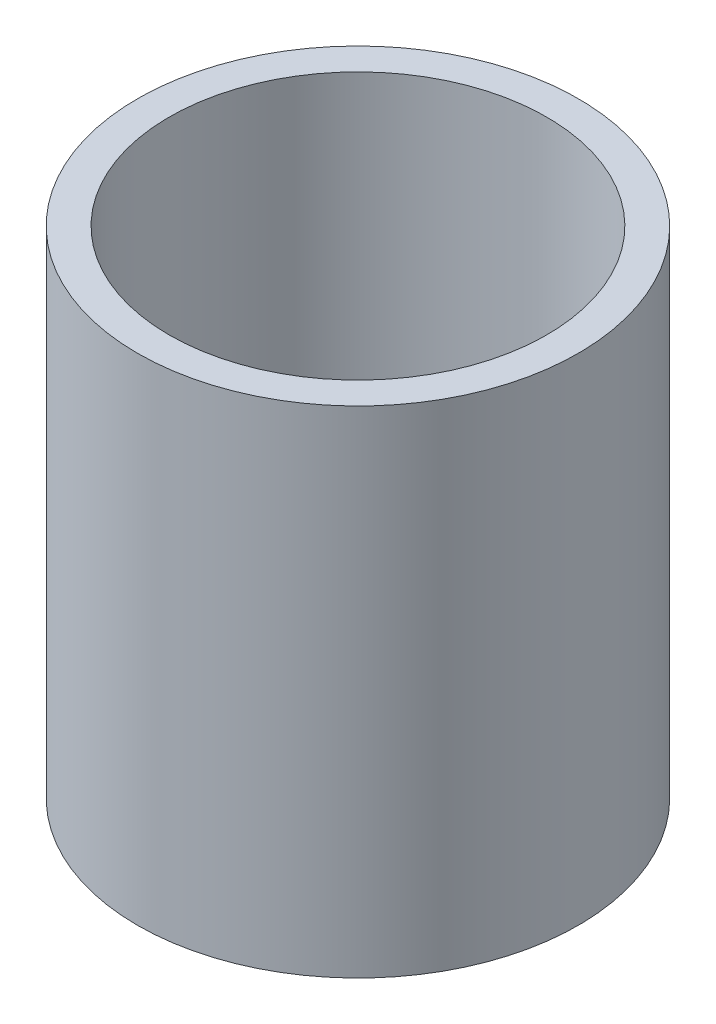
ISO-10303-21;
HEADER;
FILE_DESCRIPTION(('STEP AP214'),'2;1');
FILE_NAME('part.step','',(''),(''),'','','');
FILE_SCHEMA(('AUTOMOTIVE_DESIGN { 1 0 10303 214 1 1 1 1 }'));
ENDSEC;
DATA;
#1=APPLICATION_CONTEXT('core data for automotive mechanical design processes');
#2=APPLICATION_PROTOCOL_DEFINITION('international standard','automotive_design',2000,#1);
#3=PRODUCT_CONTEXT('',#1,'mechanical');
#4=PRODUCT('Part','Part','',(#3));
#5=PRODUCT_RELATED_PRODUCT_CATEGORY('part','',(#4));
#6=PRODUCT_DEFINITION_FORMATION('','',#4);
#7=PRODUCT_DEFINITION_CONTEXT('part definition',#1,'design');
#8=PRODUCT_DEFINITION('design','',#6,#7);
#9=PRODUCT_DEFINITION_SHAPE('','',#8);
#10=(LENGTH_UNIT() NAMED_UNIT(*) SI_UNIT(.MILLI.,.METRE.));
#11=(NAMED_UNIT(*) PLANE_ANGLE_UNIT() SI_UNIT($,.RADIAN.));
#12=(NAMED_UNIT(*) SI_UNIT($,.STERADIAN.) SOLID_ANGLE_UNIT());
#13=UNCERTAINTY_MEASURE_WITH_UNIT(LENGTH_MEASURE(1.E-05),#10,'distance_accuracy_value','');
#14=(GEOMETRIC_REPRESENTATION_CONTEXT(3) GLOBAL_UNCERTAINTY_ASSIGNED_CONTEXT((#13)) GLOBAL_UNIT_ASSIGNED_CONTEXT((#10,
#11,#12)) REPRESENTATION_CONTEXT('',''));
#15=CARTESIAN_POINT('',(0.,0.,0.));
#16=DIRECTION('',(0.,0.,1.));
#17=DIRECTION('',(1.,0.,0.));
#18=AXIS2_PLACEMENT_3D('',#15,#16,#17);
#19=CARTESIAN_POINT('',(0.,-100.,0.));
#20=DIRECTION('',(0.,1.,0.));
#21=DIRECTION('',(0.,0.,1.));
#22=AXIS2_PLACEMENT_3D('',#19,#20,#21);
#23=CYLINDRICAL_SURFACE('',#22,44.5);
#24=CARTESIAN_POINT('',(0.,-100.,0.));
#25=DIRECTION('',(0.,1.,0.));
#26=DIRECTION('',(0.,0.,1.));
#27=AXIS2_PLACEMENT_3D('',#24,#25,#26);
#28=CIRCLE('',#27,44.5);
#29=CARTESIAN_POINT('',(0.,-100.,44.5));
#30=VERTEX_POINT('',#29);
#31=EDGE_CURVE('E43',#30,#30,#28,.T.);
#32=ORIENTED_EDGE('',*,*,#31,.T.);
#33=EDGE_LOOP('',(#32));
#34=FACE_BOUND('',#33,.T.);
#35=CARTESIAN_POINT('',(0.,0.,0.));
#36=DIRECTION('',(0.,1.,0.));
#37=DIRECTION('',(0.,0.,1.));
#38=AXIS2_PLACEMENT_3D('',#35,#36,#37);
#39=CIRCLE('',#38,44.5);
#40=CARTESIAN_POINT('',(0.,0.,44.5));
#41=VERTEX_POINT('',#40);
#42=EDGE_CURVE('E49',#41,#41,#39,.T.);
#43=ORIENTED_EDGE('',*,*,#42,.F.);
#44=EDGE_LOOP('',(#43));
#45=FACE_BOUND('',#44,.T.);
#46=ADVANCED_FACE('F36',(#34,#45),#23,.T.);
#47=CARTESIAN_POINT('',(0.,-100.,0.));
#48=DIRECTION('',(0.,1.,0.));
#49=DIRECTION('',(0.,0.,1.));
#50=AXIS2_PLACEMENT_3D('',#47,#48,#49);
#51=CYLINDRICAL_SURFACE('',#50,38.1);
#52=CARTESIAN_POINT('',(0.,-100.,0.));
#53=DIRECTION('',(0.,1.,0.));
#54=DIRECTION('',(0.,0.,1.));
#55=AXIS2_PLACEMENT_3D('',#52,#53,#54);
#56=CIRCLE('',#55,38.1);
#57=CARTESIAN_POINT('',(0.,-100.,38.1));
#58=VERTEX_POINT('',#57);
#59=EDGE_CURVE('E10',#58,#58,#56,.T.);
#60=ORIENTED_EDGE('',*,*,#59,.F.);
#61=EDGE_LOOP('',(#60));
#62=FACE_BOUND('',#61,.T.);
#63=CARTESIAN_POINT('',(0.,0.,0.));
#64=DIRECTION('',(0.,1.,0.));
#65=DIRECTION('',(0.,0.,1.));
#66=AXIS2_PLACEMENT_3D('',#63,#64,#65);
#67=CIRCLE('',#66,38.1);
#68=CARTESIAN_POINT('',(0.,0.,38.1));
#69=VERTEX_POINT('',#68);
#70=EDGE_CURVE('E39',#69,#69,#67,.T.);
#71=ORIENTED_EDGE('',*,*,#70,.T.);
#72=EDGE_LOOP('',(#71));
#73=FACE_BOUND('',#72,.T.);
#74=ADVANCED_FACE('F56',(#62,#73),#51,.F.);
#75=CARTESIAN_POINT('',(0.,-100.,0.));
#76=DIRECTION('',(0.,1.,0.));
#77=DIRECTION('',(0.,0.,1.));
#78=AXIS2_PLACEMENT_3D('',#75,#76,#77);
#79=PLANE('',#78);
#80=ORIENTED_EDGE('',*,*,#31,.F.);
#81=EDGE_LOOP('',(#80));
#82=FACE_BOUND('',#81,.T.);
#83=ORIENTED_EDGE('',*,*,#59,.T.);
#84=EDGE_LOOP('',(#83));
#85=FACE_BOUND('',#84,.T.);
#86=ADVANCED_FACE('F60',(#82,#85),#79,.F.);
#87=CARTESIAN_POINT('',(0.,0.,0.));
#88=DIRECTION('',(0.,1.,0.));
#89=DIRECTION('',(0.,0.,1.));
#90=AXIS2_PLACEMENT_3D('',#87,#88,#89);
#91=PLANE('',#90);
#92=ORIENTED_EDGE('',*,*,#42,.T.);
#93=EDGE_LOOP('',(#92));
#94=FACE_BOUND('',#93,.T.);
#95=ORIENTED_EDGE('',*,*,#70,.F.);
#96=EDGE_LOOP('',(#95));
#97=FACE_BOUND('',#96,.T.);
#98=ADVANCED_FACE('F58',(#94,#97),#91,.T.);
#99=CLOSED_SHELL('',(#46,#74,#86,#98));
#100=MANIFOLD_SOLID_BREP('B2',#99);
#101=ADVANCED_BREP_SHAPE_REPRESENTATION('',(#18,#100),#14);
#102=SHAPE_DEFINITION_REPRESENTATION(#9,#101);
ENDSEC;
END-ISO-10303-21;
